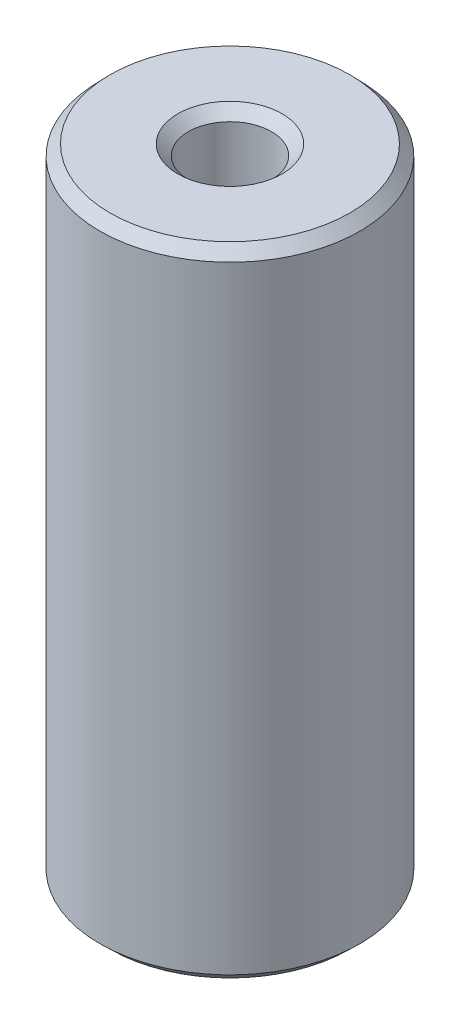
ISO-10303-21;
HEADER;
FILE_DESCRIPTION(('STEP AP214'),'2;1');
FILE_NAME('part.step','',(''),(''),'','','');
FILE_SCHEMA(('AUTOMOTIVE_DESIGN { 1 0 10303 214 1 1 1 1 }'));
ENDSEC;
DATA;
#1=APPLICATION_CONTEXT('core data for automotive mechanical design processes');
#2=APPLICATION_PROTOCOL_DEFINITION('international standard','automotive_design',2000,#1);
#3=PRODUCT_CONTEXT('',#1,'mechanical');
#4=PRODUCT('Part','Part','',(#3));
#5=PRODUCT_RELATED_PRODUCT_CATEGORY('part','',(#4));
#6=PRODUCT_DEFINITION_FORMATION('','',#4);
#7=PRODUCT_DEFINITION_CONTEXT('part definition',#1,'design');
#8=PRODUCT_DEFINITION('design','',#6,#7);
#9=PRODUCT_DEFINITION_SHAPE('','',#8);
#10=(LENGTH_UNIT() NAMED_UNIT(*) SI_UNIT(.MILLI.,.METRE.));
#11=(NAMED_UNIT(*) PLANE_ANGLE_UNIT() SI_UNIT($,.RADIAN.));
#12=(NAMED_UNIT(*) SI_UNIT($,.STERADIAN.) SOLID_ANGLE_UNIT());
#13=UNCERTAINTY_MEASURE_WITH_UNIT(LENGTH_MEASURE(1.E-05),#10,'distance_accuracy_value','');
#14=(GEOMETRIC_REPRESENTATION_CONTEXT(3) GLOBAL_UNCERTAINTY_ASSIGNED_CONTEXT((#13)) GLOBAL_UNIT_ASSIGNED_CONTEXT((#10,
#11,#12)) REPRESENTATION_CONTEXT('',''));
#15=CARTESIAN_POINT('',(0.,0.,0.));
#16=DIRECTION('',(0.,0.,1.));
#17=DIRECTION('',(1.,0.,0.));
#18=AXIS2_PLACEMENT_3D('',#15,#16,#17);
#19=CARTESIAN_POINT('',(0.,24.5314078641997,0.));
#20=DIRECTION('',(0.,-1.,0.));
#21=DIRECTION('',(0.,0.,-1.));
#22=AXIS2_PLACEMENT_3D('',#19,#20,#21);
#23=CYLINDRICAL_SURFACE('',#22,5.);
#24=CARTESIAN_POINT('',(0.,0.391591973190351,0.));
#25=DIRECTION('',(0.,1.,0.));
#26=DIRECTION('',(0.,0.,1.));
#27=AXIS2_PLACEMENT_3D('',#24,#25,#26);
#28=CIRCLE('',#27,5.);
#29=CARTESIAN_POINT('',(0.,0.391591973190351,5.));
#30=VERTEX_POINT('',#29);
#31=EDGE_CURVE('E10',#30,#30,#28,.T.);
#32=ORIENTED_EDGE('',*,*,#31,.T.);
#33=EDGE_LOOP('',(#32));
#34=FACE_BOUND('',#33,.T.);
#35=CARTESIAN_POINT('',(0.,24.123670286361,0.));
#36=DIRECTION('',(0.,1.,0.));
#37=DIRECTION('',(0.,0.,1.));
#38=AXIS2_PLACEMENT_3D('',#35,#36,#37);
#39=CIRCLE('',#38,5.);
#40=CARTESIAN_POINT('',(0.,24.123670286361,5.));
#41=VERTEX_POINT('',#40);
#42=EDGE_CURVE('E50',#41,#41,#39,.F.);
#43=ORIENTED_EDGE('',*,*,#42,.T.);
#44=EDGE_LOOP('',(#43));
#45=FACE_BOUND('',#44,.T.);
#46=ADVANCED_FACE('F39',(#34,#45),#23,.T.);
#47=CARTESIAN_POINT('',(0.,24.5314078641997,0.));
#48=DIRECTION('',(0.,1.,0.));
#49=DIRECTION('',(0.,0.,1.));
#50=AXIS2_PLACEMENT_3D('',#47,#48,#49);
#51=PLANE('',#50);
#52=CARTESIAN_POINT('',(0.,24.5314078641997,0.));
#53=DIRECTION('',(0.,1.,0.));
#54=DIRECTION('',(0.,0.,1.));
#55=AXIS2_PLACEMENT_3D('',#52,#53,#54);
#56=CIRCLE('',#55,2.00578367776547);
#57=CARTESIAN_POINT('',(0.,24.5314078641997,2.00578367776547));
#58=VERTEX_POINT('',#57);
#59=EDGE_CURVE('E58',#58,#58,#56,.F.);
#60=ORIENTED_EDGE('',*,*,#59,.T.);
#61=EDGE_LOOP('',(#60));
#62=FACE_BOUND('',#61,.T.);
#63=CARTESIAN_POINT('',(0.,24.5314078641997,0.));
#64=DIRECTION('',(0.,1.,0.));
#65=DIRECTION('',(0.,0.,1.));
#66=AXIS2_PLACEMENT_3D('',#63,#64,#65);
#67=CIRCLE('',#66,4.60840802680964);
#68=CARTESIAN_POINT('',(0.,24.5314078641997,4.60840802680964));
#69=VERTEX_POINT('',#68);
#70=EDGE_CURVE('E61',#69,#69,#67,.T.);
#71=ORIENTED_EDGE('',*,*,#70,.T.);
#72=EDGE_LOOP('',(#71));
#73=FACE_BOUND('',#72,.T.);
#74=ADVANCED_FACE('F88',(#62,#73),#51,.T.);
#75=CARTESIAN_POINT('',(0.,0.,0.));
#76=DIRECTION('',(0.,1.,0.));
#77=DIRECTION('',(0.,0.,1.));
#78=AXIS2_PLACEMENT_3D('',#75,#76,#77);
#79=PLANE('',#78);
#80=CARTESIAN_POINT('',(0.,0.,0.));
#81=DIRECTION('',(0.,1.,0.));
#82=DIRECTION('',(0.,0.,1.));
#83=AXIS2_PLACEMENT_3D('',#80,#81,#82);
#84=CIRCLE('',#83,1.98963807311716);
#85=CARTESIAN_POINT('',(0.,0.,1.98963807311716));
#86=VERTEX_POINT('',#85);
#87=EDGE_CURVE('E51',#86,#86,#84,.T.);
#88=ORIENTED_EDGE('',*,*,#87,.T.);
#89=EDGE_LOOP('',(#88));
#90=FACE_BOUND('',#89,.T.);
#91=CARTESIAN_POINT('',(0.,0.,0.));
#92=DIRECTION('',(0.,1.,0.));
#93=DIRECTION('',(0.,0.,1.));
#94=AXIS2_PLACEMENT_3D('',#91,#92,#93);
#95=CIRCLE('',#94,4.59226242216133);
#96=CARTESIAN_POINT('',(0.,0.,4.59226242216133));
#97=VERTEX_POINT('',#96);
#98=EDGE_CURVE('E54',#97,#97,#95,.F.);
#99=ORIENTED_EDGE('',*,*,#98,.T.);
#100=EDGE_LOOP('',(#99));
#101=FACE_BOUND('',#100,.T.);
#102=ADVANCED_FACE('F83',(#90,#101),#79,.F.);
#103=CARTESIAN_POINT('',(0.,24.5314078641997,0.));
#104=DIRECTION('',(0.,-1.,0.));
#105=DIRECTION('',(0.,0.,-1.));
#106=AXIS2_PLACEMENT_3D('',#103,#104,#105);
#107=CYLINDRICAL_SURFACE('',#106,1.5980460999268);
#108=CARTESIAN_POINT('',(0.,24.1398158910094,0.));
#109=DIRECTION('',(0.,1.,0.));
#110=DIRECTION('',(0.,0.,1.));
#111=AXIS2_PLACEMENT_3D('',#108,#109,#110);
#112=CIRCLE('',#111,1.5980460999268);
#113=CARTESIAN_POINT('',(0.,24.1398158910094,1.5980460999268));
#114=VERTEX_POINT('',#113);
#115=EDGE_CURVE('E67',#114,#114,#112,.T.);
#116=ORIENTED_EDGE('',*,*,#115,.T.);
#117=EDGE_LOOP('',(#116));
#118=FACE_BOUND('',#117,.T.);
#119=CARTESIAN_POINT('',(0.,0.407737577838678,0.));
#120=DIRECTION('',(0.,1.,0.));
#121=DIRECTION('',(0.,0.,1.));
#122=AXIS2_PLACEMENT_3D('',#119,#120,#121);
#123=CIRCLE('',#122,1.5980460999268);
#124=CARTESIAN_POINT('',(0.,0.407737577838678,1.5980460999268));
#125=VERTEX_POINT('',#124);
#126=EDGE_CURVE('E69',#125,#125,#123,.F.);
#127=ORIENTED_EDGE('',*,*,#126,.T.);
#128=EDGE_LOOP('',(#127));
#129=FACE_BOUND('',#128,.T.);
#130=ADVANCED_FACE('F71',(#118,#129),#107,.F.);
#131=CARTESIAN_POINT('',(0.,24.1398158910094,0.));
#132=DIRECTION('',(0.,1.,0.));
#133=DIRECTION('',(0.,0.,1.));
#134=AXIS2_PLACEMENT_3D('',#131,#132,#133);
#135=CONICAL_SURFACE('',#134,1.5980460999268,0.805594350788773);
#136=ORIENTED_EDGE('',*,*,#59,.F.);
#137=EDGE_LOOP('',(#136));
#138=FACE_BOUND('',#137,.T.);
#139=ORIENTED_EDGE('',*,*,#115,.F.);
#140=EDGE_LOOP('',(#139));
#141=FACE_BOUND('',#140,.T.);
#142=ADVANCED_FACE('F77',(#138,#141),#135,.F.);
#143=CARTESIAN_POINT('',(0.,0.,0.));
#144=DIRECTION('',(0.,-1.,0.));
#145=DIRECTION('',(0.,0.,-1.));
#146=AXIS2_PLACEMENT_3D('',#143,#144,#145);
#147=CONICAL_SURFACE('',#146,1.98963807311716,0.765201976006123);
#148=ORIENTED_EDGE('',*,*,#126,.F.);
#149=EDGE_LOOP('',(#148));
#150=FACE_BOUND('',#149,.T.);
#151=ORIENTED_EDGE('',*,*,#87,.F.);
#152=EDGE_LOOP('',(#151));
#153=FACE_BOUND('',#152,.T.);
#154=ADVANCED_FACE('F73',(#150,#153),#147,.F.);
#155=CARTESIAN_POINT('',(0.,0.391591973190351,0.));
#156=DIRECTION('',(0.,1.,0.));
#157=DIRECTION('',(0.,0.,1.));
#158=AXIS2_PLACEMENT_3D('',#155,#156,#157);
#159=CONICAL_SURFACE('',#158,5.,0.805594350788776);
#160=ORIENTED_EDGE('',*,*,#98,.F.);
#161=EDGE_LOOP('',(#160));
#162=FACE_BOUND('',#161,.T.);
#163=ORIENTED_EDGE('',*,*,#31,.F.);
#164=EDGE_LOOP('',(#163));
#165=FACE_BOUND('',#164,.T.);
#166=ADVANCED_FACE('F76',(#162,#165),#159,.T.);
#167=CARTESIAN_POINT('',(0.,24.5314078641997,0.));
#168=DIRECTION('',(0.,-1.,0.));
#169=DIRECTION('',(0.,0.,-1.));
#170=AXIS2_PLACEMENT_3D('',#167,#168,#169);
#171=CONICAL_SURFACE('',#170,4.60840802680964,0.765201976006123);
#172=ORIENTED_EDGE('',*,*,#42,.F.);
#173=EDGE_LOOP('',(#172));
#174=FACE_BOUND('',#173,.T.);
#175=ORIENTED_EDGE('',*,*,#70,.F.);
#176=EDGE_LOOP('',(#175));
#177=FACE_BOUND('',#176,.T.);
#178=ADVANCED_FACE('F45',(#174,#177),#171,.T.);
#179=CLOSED_SHELL('',(#46,#74,#102,#130,#142,#154,#166,#178));
#180=MANIFOLD_SOLID_BREP('B2',#179);
#181=ADVANCED_BREP_SHAPE_REPRESENTATION('',(#18,#180),#14);
#182=SHAPE_DEFINITION_REPRESENTATION(#9,#181);
ENDSEC;
END-ISO-10303-21;
